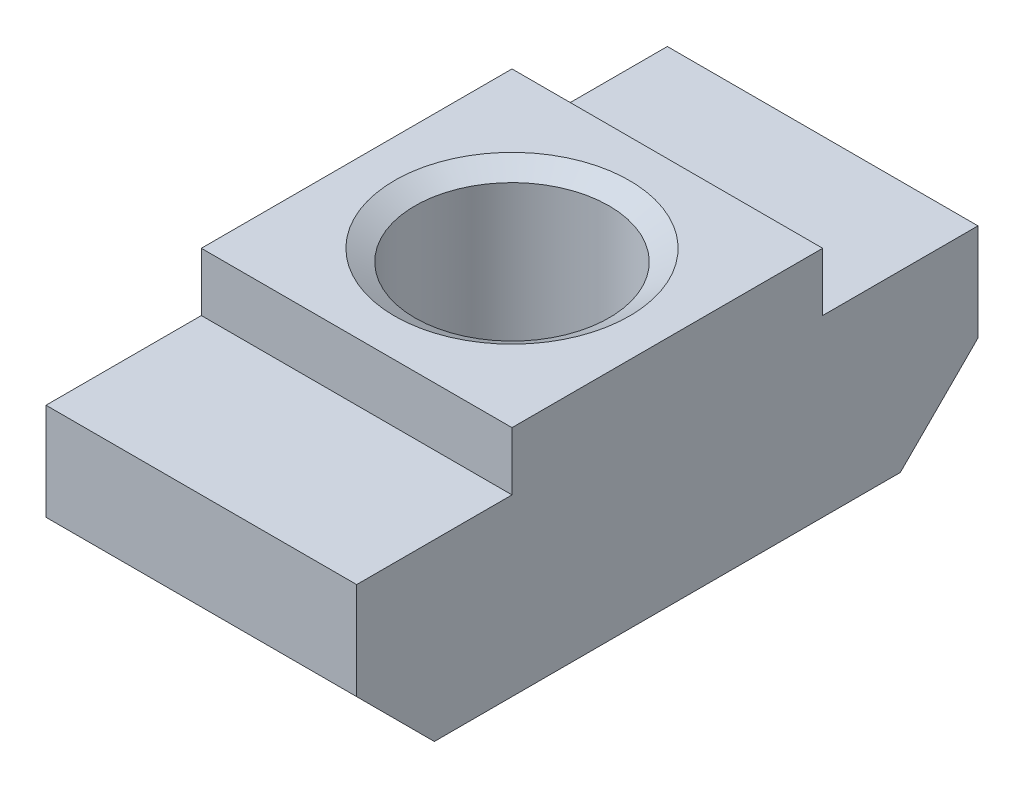
ISO-10303-21;
HEADER;
FILE_DESCRIPTION(('STEP AP214'),'2;1');
FILE_NAME('part.step','',(''),(''),'','','');
FILE_SCHEMA(('AUTOMOTIVE_DESIGN { 1 0 10303 214 1 1 1 1 }'));
ENDSEC;
DATA;
#1=APPLICATION_CONTEXT('core data for automotive mechanical design processes');
#2=APPLICATION_PROTOCOL_DEFINITION('international standard','automotive_design',2000,#1);
#3=PRODUCT_CONTEXT('',#1,'mechanical');
#4=PRODUCT('Part','Part','',(#3));
#5=PRODUCT_RELATED_PRODUCT_CATEGORY('part','',(#4));
#6=PRODUCT_DEFINITION_FORMATION('','',#4);
#7=PRODUCT_DEFINITION_CONTEXT('part definition',#1,'design');
#8=PRODUCT_DEFINITION('design','',#6,#7);
#9=PRODUCT_DEFINITION_SHAPE('','',#8);
#10=(LENGTH_UNIT() NAMED_UNIT(*) SI_UNIT(.MILLI.,.METRE.));
#11=(NAMED_UNIT(*) PLANE_ANGLE_UNIT() SI_UNIT($,.RADIAN.));
#12=(NAMED_UNIT(*) SI_UNIT($,.STERADIAN.) SOLID_ANGLE_UNIT());
#13=UNCERTAINTY_MEASURE_WITH_UNIT(LENGTH_MEASURE(1.E-05),#10,'distance_accuracy_value','');
#14=(GEOMETRIC_REPRESENTATION_CONTEXT(3) GLOBAL_UNCERTAINTY_ASSIGNED_CONTEXT((#13)) GLOBAL_UNIT_ASSIGNED_CONTEXT((#10,
#11,#12)) REPRESENTATION_CONTEXT('',''));
#15=CARTESIAN_POINT('',(0.,0.,0.));
#16=DIRECTION('',(0.,0.,1.));
#17=DIRECTION('',(1.,0.,0.));
#18=AXIS2_PLACEMENT_3D('',#15,#16,#17);
#19=CARTESIAN_POINT('',(4.,0.,16.));
#20=DIRECTION('',(-1.,0.,0.));
#21=DIRECTION('',(0.,0.,1.));
#22=AXIS2_PLACEMENT_3D('',#19,#20,#21);
#23=PLANE('',#22);
#24=DIRECTION('',(0.,0.,1.));
#25=VECTOR('',#24,1.);
#26=CARTESIAN_POINT('',(4.,4.5,16.));
#27=LINE('',#26,#25);
#28=CARTESIAN_POINT('',(4.,4.5,0.));
#29=VERTEX_POINT('',#28);
#30=CARTESIAN_POINT('',(4.,4.5,4.));
#31=VERTEX_POINT('',#30);
#32=EDGE_CURVE('E51',#29,#31,#27,.T.);
#33=ORIENTED_EDGE('',*,*,#32,.T.);
#34=DIRECTION('',(0.,1.,0.));
#35=VECTOR('',#34,1.);
#36=CARTESIAN_POINT('',(4.,0.,4.));
#37=LINE('',#36,#35);
#38=CARTESIAN_POINT('',(4.,6.,4.));
#39=VERTEX_POINT('',#38);
#40=EDGE_CURVE('E200',#31,#39,#37,.T.);
#41=ORIENTED_EDGE('',*,*,#40,.T.);
#42=DIRECTION('',(0.,0.,-1.));
#43=VECTOR('',#42,1.);
#44=CARTESIAN_POINT('',(4.,6.,16.));
#45=LINE('',#44,#43);
#46=CARTESIAN_POINT('',(4.,6.,12.));
#47=VERTEX_POINT('',#46);
#48=EDGE_CURVE('E147',#47,#39,#45,.T.);
#49=ORIENTED_EDGE('',*,*,#48,.F.);
#50=DIRECTION('',(0.,-1.,0.));
#51=VECTOR('',#50,1.);
#52=CARTESIAN_POINT('',(4.,0.,12.));
#53=LINE('',#52,#51);
#54=CARTESIAN_POINT('',(4.,4.5,12.));
#55=VERTEX_POINT('',#54);
#56=EDGE_CURVE('E187',#47,#55,#53,.T.);
#57=ORIENTED_EDGE('',*,*,#56,.T.);
#58=DIRECTION('',(0.,0.,1.));
#59=VECTOR('',#58,1.);
#60=CARTESIAN_POINT('',(4.,4.5,16.));
#61=LINE('',#60,#59);
#62=CARTESIAN_POINT('',(4.,4.5,16.));
#63=VERTEX_POINT('',#62);
#64=EDGE_CURVE('E190',#55,#63,#61,.T.);
#65=ORIENTED_EDGE('',*,*,#64,.T.);
#66=DIRECTION('',(0.,1.,0.));
#67=VECTOR('',#66,1.);
#68=CARTESIAN_POINT('',(4.,0.,16.));
#69=LINE('',#68,#67);
#70=CARTESIAN_POINT('',(4.,2.,16.));
#71=VERTEX_POINT('',#70);
#72=EDGE_CURVE('E131',#71,#63,#69,.T.);
#73=ORIENTED_EDGE('',*,*,#72,.F.);
#74=DIRECTION('',(0.,-0.707106781186548,-0.707106781186547));
#75=VECTOR('',#74,1.);
#76=CARTESIAN_POINT('',(4.,0.999999999999999,15.));
#77=LINE('',#76,#75);
#78=CARTESIAN_POINT('',(4.,0.,14.));
#79=VERTEX_POINT('',#78);
#80=EDGE_CURVE('E180',#71,#79,#77,.T.);
#81=ORIENTED_EDGE('',*,*,#80,.T.);
#82=DIRECTION('',(0.,0.,-1.));
#83=VECTOR('',#82,1.);
#84=CARTESIAN_POINT('',(4.,0.,16.));
#85=LINE('',#84,#83);
#86=CARTESIAN_POINT('',(4.,0.,2.));
#87=VERTEX_POINT('',#86);
#88=EDGE_CURVE('E141',#79,#87,#85,.T.);
#89=ORIENTED_EDGE('',*,*,#88,.T.);
#90=DIRECTION('',(0.,0.707106781186548,-0.707106781186547));
#91=VECTOR('',#90,1.);
#92=CARTESIAN_POINT('',(4.,-7.,9.));
#93=LINE('',#92,#91);
#94=CARTESIAN_POINT('',(4.,2.,0.));
#95=VERTEX_POINT('',#94);
#96=EDGE_CURVE('E172',#87,#95,#93,.T.);
#97=ORIENTED_EDGE('',*,*,#96,.T.);
#98=DIRECTION('',(0.,1.,0.));
#99=VECTOR('',#98,1.);
#100=CARTESIAN_POINT('',(4.,0.,0.));
#101=LINE('',#100,#99);
#102=EDGE_CURVE('E132',#95,#29,#101,.T.);
#103=ORIENTED_EDGE('',*,*,#102,.T.);
#104=EDGE_LOOP('',(#33,#41,#49,#57,#65,#73,#81,#89,#97,#103));
#105=FACE_BOUND('',#104,.T.);
#106=ADVANCED_FACE('F38',(#105),#23,.F.);
#107=CARTESIAN_POINT('',(-4.,6.,16.));
#108=DIRECTION('',(0.,-1.,0.));
#109=DIRECTION('',(0.,0.,-1.));
#110=AXIS2_PLACEMENT_3D('',#107,#108,#109);
#111=PLANE('',#110);
#112=CARTESIAN_POINT('',(0.,6.,8.));
#113=DIRECTION('',(0.,1.,0.));
#114=DIRECTION('',(0.,0.,1.));
#115=AXIS2_PLACEMENT_3D('',#112,#113,#114);
#116=CIRCLE('',#115,3.025);
#117=CARTESIAN_POINT('',(0.,6.,11.025));
#118=VERTEX_POINT('',#117);
#119=EDGE_CURVE('E169',#118,#118,#116,.T.);
#120=ORIENTED_EDGE('',*,*,#119,.F.);
#121=EDGE_LOOP('',(#120));
#122=FACE_BOUND('',#121,.T.);
#123=ORIENTED_EDGE('',*,*,#48,.T.);
#124=DIRECTION('',(-1.,0.,0.));
#125=VECTOR('',#124,1.);
#126=CARTESIAN_POINT('',(6.,6.,4.));
#127=LINE('',#126,#125);
#128=CARTESIAN_POINT('',(-4.,6.,4.));
#129=VERTEX_POINT('',#128);
#130=EDGE_CURVE('E204',#39,#129,#127,.T.);
#131=ORIENTED_EDGE('',*,*,#130,.T.);
#132=DIRECTION('',(0.,0.,-1.));
#133=VECTOR('',#132,1.);
#134=CARTESIAN_POINT('',(-4.,6.,16.));
#135=LINE('',#134,#133);
#136=CARTESIAN_POINT('',(-4.,6.,12.));
#137=VERTEX_POINT('',#136);
#138=EDGE_CURVE('E145',#137,#129,#135,.T.);
#139=ORIENTED_EDGE('',*,*,#138,.F.);
#140=DIRECTION('',(-1.,0.,0.));
#141=VECTOR('',#140,1.);
#142=CARTESIAN_POINT('',(6.,6.,12.));
#143=LINE('',#142,#141);
#144=EDGE_CURVE('E193',#47,#137,#143,.T.);
#145=ORIENTED_EDGE('',*,*,#144,.F.);
#146=EDGE_LOOP('',(#123,#131,#139,#145));
#147=FACE_BOUND('',#146,.T.);
#148=ADVANCED_FACE('F213',(#122,#147),#111,.F.);
#149=CARTESIAN_POINT('',(-4.,0.,16.));
#150=DIRECTION('',(1.,0.,0.));
#151=DIRECTION('',(0.,0.,-1.));
#152=AXIS2_PLACEMENT_3D('',#149,#150,#151);
#153=PLANE('',#152);
#154=ORIENTED_EDGE('',*,*,#138,.T.);
#155=DIRECTION('',(0.,1.,0.));
#156=VECTOR('',#155,1.);
#157=CARTESIAN_POINT('',(-4.,4.5,4.));
#158=LINE('',#157,#156);
#159=CARTESIAN_POINT('',(-4.,4.5,4.));
#160=VERTEX_POINT('',#159);
#161=EDGE_CURVE('E126',#160,#129,#158,.T.);
#162=ORIENTED_EDGE('',*,*,#161,.F.);
#163=DIRECTION('',(0.,0.,1.));
#164=VECTOR('',#163,1.);
#165=CARTESIAN_POINT('',(-4.,4.5,0.));
#166=LINE('',#165,#164);
#167=CARTESIAN_POINT('',(-4.,4.5,0.));
#168=VERTEX_POINT('',#167);
#169=EDGE_CURVE('E114',#168,#160,#166,.T.);
#170=ORIENTED_EDGE('',*,*,#169,.F.);
#171=DIRECTION('',(0.,-1.,0.));
#172=VECTOR('',#171,1.);
#173=CARTESIAN_POINT('',(-4.,0.,0.));
#174=LINE('',#173,#172);
#175=CARTESIAN_POINT('',(-4.,2.,0.));
#176=VERTEX_POINT('',#175);
#177=EDGE_CURVE('E124',#168,#176,#174,.T.);
#178=ORIENTED_EDGE('',*,*,#177,.T.);
#179=DIRECTION('',(0.,0.707106781186548,-0.707106781186547));
#180=VECTOR('',#179,1.);
#181=CARTESIAN_POINT('',(-4.,2.,0.));
#182=LINE('',#181,#180);
#183=CARTESIAN_POINT('',(-4.,0.,2.));
#184=VERTEX_POINT('',#183);
#185=EDGE_CURVE('E178',#184,#176,#182,.T.);
#186=ORIENTED_EDGE('',*,*,#185,.F.);
#187=DIRECTION('',(0.,0.,-1.));
#188=VECTOR('',#187,1.);
#189=CARTESIAN_POINT('',(-4.,0.,16.));
#190=LINE('',#189,#188);
#191=CARTESIAN_POINT('',(-4.,0.,14.));
#192=VERTEX_POINT('',#191);
#193=EDGE_CURVE('E143',#192,#184,#190,.T.);
#194=ORIENTED_EDGE('',*,*,#193,.F.);
#195=DIRECTION('',(0.,-0.707106781186548,-0.707106781186547));
#196=VECTOR('',#195,1.);
#197=CARTESIAN_POINT('',(-4.,2.,16.));
#198=LINE('',#197,#196);
#199=CARTESIAN_POINT('',(-4.,2.,16.));
#200=VERTEX_POINT('',#199);
#201=EDGE_CURVE('E162',#200,#192,#198,.T.);
#202=ORIENTED_EDGE('',*,*,#201,.F.);
#203=DIRECTION('',(0.,-1.,0.));
#204=VECTOR('',#203,1.);
#205=CARTESIAN_POINT('',(-4.,0.,16.));
#206=LINE('',#205,#204);
#207=CARTESIAN_POINT('',(-4.,4.5,16.));
#208=VERTEX_POINT('',#207);
#209=EDGE_CURVE('E135',#208,#200,#206,.T.);
#210=ORIENTED_EDGE('',*,*,#209,.F.);
#211=DIRECTION('',(0.,0.,1.));
#212=VECTOR('',#211,1.);
#213=CARTESIAN_POINT('',(-4.,4.5,16.));
#214=LINE('',#213,#212);
#215=CARTESIAN_POINT('',(-4.,4.5,12.));
#216=VERTEX_POINT('',#215);
#217=EDGE_CURVE('E59',#216,#208,#214,.T.);
#218=ORIENTED_EDGE('',*,*,#217,.F.);
#219=DIRECTION('',(0.,-1.,0.));
#220=VECTOR('',#219,1.);
#221=CARTESIAN_POINT('',(-4.,4.5,12.));
#222=LINE('',#221,#220);
#223=EDGE_CURVE('E197',#137,#216,#222,.T.);
#224=ORIENTED_EDGE('',*,*,#223,.F.);
#225=EDGE_LOOP('',(#154,#162,#170,#178,#186,#194,#202,#210,#218,#224));
#226=FACE_BOUND('',#225,.T.);
#227=ADVANCED_FACE('F122',(#226),#153,.F.);
#228=CARTESIAN_POINT('',(-4.,0.,16.));
#229=DIRECTION('',(0.,1.,0.));
#230=DIRECTION('',(0.,0.,1.));
#231=AXIS2_PLACEMENT_3D('',#228,#229,#230);
#232=PLANE('',#231);
#233=CARTESIAN_POINT('',(0.,0.,8.));
#234=DIRECTION('',(0.,1.,0.));
#235=DIRECTION('',(0.,0.,1.));
#236=AXIS2_PLACEMENT_3D('',#233,#234,#235);
#237=CIRCLE('',#236,2.5);
#238=CARTESIAN_POINT('',(0.,0.,10.5));
#239=VERTEX_POINT('',#238);
#240=EDGE_CURVE('E137',#239,#239,#237,.T.);
#241=ORIENTED_EDGE('',*,*,#240,.T.);
#242=EDGE_LOOP('',(#241));
#243=FACE_BOUND('',#242,.T.);
#244=ORIENTED_EDGE('',*,*,#88,.F.);
#245=DIRECTION('',(-1.,0.,0.));
#246=VECTOR('',#245,1.);
#247=CARTESIAN_POINT('',(6.,0.,14.));
#248=LINE('',#247,#246);
#249=EDGE_CURVE('E183',#79,#192,#248,.T.);
#250=ORIENTED_EDGE('',*,*,#249,.T.);
#251=ORIENTED_EDGE('',*,*,#193,.T.);
#252=DIRECTION('',(-1.,0.,0.));
#253=VECTOR('',#252,1.);
#254=CARTESIAN_POINT('',(6.,0.,2.));
#255=LINE('',#254,#253);
#256=EDGE_CURVE('E175',#87,#184,#255,.T.);
#257=ORIENTED_EDGE('',*,*,#256,.F.);
#258=EDGE_LOOP('',(#244,#250,#251,#257));
#259=FACE_BOUND('',#258,.T.);
#260=ADVANCED_FACE('F226',(#243,#259),#232,.F.);
#261=CARTESIAN_POINT('',(0.,0.,16.));
#262=DIRECTION('',(0.,0.,-1.));
#263=DIRECTION('',(-1.,0.,0.));
#264=AXIS2_PLACEMENT_3D('',#261,#262,#263);
#265=PLANE('',#264);
#266=ORIENTED_EDGE('',*,*,#72,.T.);
#267=DIRECTION('',(-1.,0.,0.));
#268=VECTOR('',#267,1.);
#269=CARTESIAN_POINT('',(0.,4.5,16.));
#270=LINE('',#269,#268);
#271=EDGE_CURVE('E45',#63,#208,#270,.T.);
#272=ORIENTED_EDGE('',*,*,#271,.T.);
#273=ORIENTED_EDGE('',*,*,#209,.T.);
#274=DIRECTION('',(1.,0.,0.));
#275=VECTOR('',#274,1.);
#276=CARTESIAN_POINT('',(0.,2.,16.));
#277=LINE('',#276,#275);
#278=EDGE_CURVE('E151',#200,#71,#277,.T.);
#279=ORIENTED_EDGE('',*,*,#278,.T.);
#280=EDGE_LOOP('',(#266,#272,#273,#279));
#281=FACE_BOUND('',#280,.T.);
#282=ADVANCED_FACE('F155',(#281),#265,.F.);
#283=CARTESIAN_POINT('',(0.,0.,0.));
#284=DIRECTION('',(0.,0.,-1.));
#285=DIRECTION('',(-1.,0.,0.));
#286=AXIS2_PLACEMENT_3D('',#283,#284,#285);
#287=PLANE('',#286);
#288=DIRECTION('',(-1.,0.,0.));
#289=VECTOR('',#288,1.);
#290=CARTESIAN_POINT('',(0.,4.5,0.));
#291=LINE('',#290,#289);
#292=EDGE_CURVE('E11',#29,#168,#291,.T.);
#293=ORIENTED_EDGE('',*,*,#292,.F.);
#294=ORIENTED_EDGE('',*,*,#102,.F.);
#295=DIRECTION('',(1.,0.,0.));
#296=VECTOR('',#295,1.);
#297=CARTESIAN_POINT('',(0.,2.,0.));
#298=LINE('',#297,#296);
#299=EDGE_CURVE('E130',#176,#95,#298,.T.);
#300=ORIENTED_EDGE('',*,*,#299,.F.);
#301=ORIENTED_EDGE('',*,*,#177,.F.);
#302=EDGE_LOOP('',(#293,#294,#300,#301));
#303=FACE_BOUND('',#302,.T.);
#304=ADVANCED_FACE('F129',(#303),#287,.T.);
#305=CARTESIAN_POINT('',(0.,6.,8.));
#306=DIRECTION('',(0.,1.,0.));
#307=DIRECTION('',(0.,0.,1.));
#308=AXIS2_PLACEMENT_3D('',#305,#306,#307);
#309=CYLINDRICAL_SURFACE('',#308,2.5);
#310=ORIENTED_EDGE('',*,*,#240,.F.);
#311=EDGE_LOOP('',(#310));
#312=FACE_BOUND('',#311,.T.);
#313=CARTESIAN_POINT('',(0.,5.69689110867544,8.));
#314=DIRECTION('',(0.,1.,0.));
#315=DIRECTION('',(0.,0.,1.));
#316=AXIS2_PLACEMENT_3D('',#313,#314,#315);
#317=CIRCLE('',#316,2.5);
#318=CARTESIAN_POINT('',(0.,5.69689110867544,10.5));
#319=VERTEX_POINT('',#318);
#320=EDGE_CURVE('E166',#319,#319,#317,.T.);
#321=ORIENTED_EDGE('',*,*,#320,.T.);
#322=EDGE_LOOP('',(#321));
#323=FACE_BOUND('',#322,.T.);
#324=ADVANCED_FACE('F255',(#312,#323),#309,.F.);
#325=CARTESIAN_POINT('',(0.,6.,8.));
#326=DIRECTION('',(0.,1.,0.));
#327=DIRECTION('',(0.,0.,1.));
#328=AXIS2_PLACEMENT_3D('',#325,#326,#327);
#329=CONICAL_SURFACE('',#328,3.025,1.0471975511966);
#330=ORIENTED_EDGE('',*,*,#320,.F.);
#331=EDGE_LOOP('',(#330));
#332=FACE_BOUND('',#331,.T.);
#333=ORIENTED_EDGE('',*,*,#119,.T.);
#334=EDGE_LOOP('',(#333));
#335=FACE_BOUND('',#334,.T.);
#336=ADVANCED_FACE('F260',(#332,#335),#329,.F.);
#337=CARTESIAN_POINT('',(6.,2.,0.));
#338=DIRECTION('',(0.,0.707106781186547,0.707106781186548));
#339=DIRECTION('',(0.,-0.707106781186548,0.707106781186547));
#340=AXIS2_PLACEMENT_3D('',#337,#338,#339);
#341=PLANE('',#340);
#342=ORIENTED_EDGE('',*,*,#256,.T.);
#343=ORIENTED_EDGE('',*,*,#185,.T.);
#344=ORIENTED_EDGE('',*,*,#299,.T.);
#345=ORIENTED_EDGE('',*,*,#96,.F.);
#346=EDGE_LOOP('',(#342,#343,#344,#345));
#347=FACE_BOUND('',#346,.T.);
#348=ADVANCED_FACE('F224',(#347),#341,.F.);
#349=CARTESIAN_POINT('',(6.,2.,16.));
#350=DIRECTION('',(0.,0.707106781186547,-0.707106781186548));
#351=DIRECTION('',(0.,0.707106781186548,0.707106781186547));
#352=AXIS2_PLACEMENT_3D('',#349,#350,#351);
#353=PLANE('',#352);
#354=ORIENTED_EDGE('',*,*,#278,.F.);
#355=ORIENTED_EDGE('',*,*,#201,.T.);
#356=ORIENTED_EDGE('',*,*,#249,.F.);
#357=ORIENTED_EDGE('',*,*,#80,.F.);
#358=EDGE_LOOP('',(#354,#355,#356,#357));
#359=FACE_BOUND('',#358,.T.);
#360=ADVANCED_FACE('F228',(#359),#353,.F.);
#361=CARTESIAN_POINT('',(6.,4.5,12.));
#362=DIRECTION('',(0.,0.,-1.));
#363=DIRECTION('',(-1.,0.,0.));
#364=AXIS2_PLACEMENT_3D('',#361,#362,#363);
#365=PLANE('',#364);
#366=ORIENTED_EDGE('',*,*,#144,.T.);
#367=ORIENTED_EDGE('',*,*,#223,.T.);
#368=DIRECTION('',(-1.,0.,0.));
#369=VECTOR('',#368,1.);
#370=CARTESIAN_POINT('',(6.,4.5,12.));
#371=LINE('',#370,#369);
#372=EDGE_CURVE('E192',#55,#216,#371,.T.);
#373=ORIENTED_EDGE('',*,*,#372,.F.);
#374=ORIENTED_EDGE('',*,*,#56,.F.);
#375=EDGE_LOOP('',(#366,#367,#373,#374));
#376=FACE_BOUND('',#375,.T.);
#377=ADVANCED_FACE('F218',(#376),#365,.F.);
#378=CARTESIAN_POINT('',(6.,4.5,16.));
#379=DIRECTION('',(0.,-1.,0.));
#380=DIRECTION('',(0.,0.,-1.));
#381=AXIS2_PLACEMENT_3D('',#378,#379,#380);
#382=PLANE('',#381);
#383=ORIENTED_EDGE('',*,*,#372,.T.);
#384=ORIENTED_EDGE('',*,*,#217,.T.);
#385=ORIENTED_EDGE('',*,*,#271,.F.);
#386=ORIENTED_EDGE('',*,*,#64,.F.);
#387=EDGE_LOOP('',(#383,#384,#385,#386));
#388=FACE_BOUND('',#387,.T.);
#389=ADVANCED_FACE('F229',(#388),#382,.F.);
#390=CARTESIAN_POINT('',(6.,4.5,4.));
#391=DIRECTION('',(0.,0.,1.));
#392=DIRECTION('',(1.,0.,0.));
#393=AXIS2_PLACEMENT_3D('',#390,#391,#392);
#394=PLANE('',#393);
#395=DIRECTION('',(-1.,0.,0.));
#396=VECTOR('',#395,1.);
#397=CARTESIAN_POINT('',(6.,4.5,4.));
#398=LINE('',#397,#396);
#399=EDGE_CURVE('E205',#31,#160,#398,.T.);
#400=ORIENTED_EDGE('',*,*,#399,.T.);
#401=ORIENTED_EDGE('',*,*,#161,.T.);
#402=ORIENTED_EDGE('',*,*,#130,.F.);
#403=ORIENTED_EDGE('',*,*,#40,.F.);
#404=EDGE_LOOP('',(#400,#401,#402,#403));
#405=FACE_BOUND('',#404,.T.);
#406=ADVANCED_FACE('F210',(#405),#394,.F.);
#407=CARTESIAN_POINT('',(6.,4.5,0.));
#408=DIRECTION('',(0.,-1.,0.));
#409=DIRECTION('',(0.,0.,-1.));
#410=AXIS2_PLACEMENT_3D('',#407,#408,#409);
#411=PLANE('',#410);
#412=ORIENTED_EDGE('',*,*,#292,.T.);
#413=ORIENTED_EDGE('',*,*,#169,.T.);
#414=ORIENTED_EDGE('',*,*,#399,.F.);
#415=ORIENTED_EDGE('',*,*,#32,.F.);
#416=EDGE_LOOP('',(#412,#413,#414,#415));
#417=FACE_BOUND('',#416,.T.);
#418=ADVANCED_FACE('F113',(#417),#411,.F.);
#419=CLOSED_SHELL('',(#106,#148,#227,#260,#282,#304,#324,#336,#348,#360,#377,#389,#406,#418));
#420=MANIFOLD_SOLID_BREP('B2',#419);
#421=ADVANCED_BREP_SHAPE_REPRESENTATION('',(#18,#420),#14);
#422=SHAPE_DEFINITION_REPRESENTATION(#9,#421);
ENDSEC;
END-ISO-10303-21;
